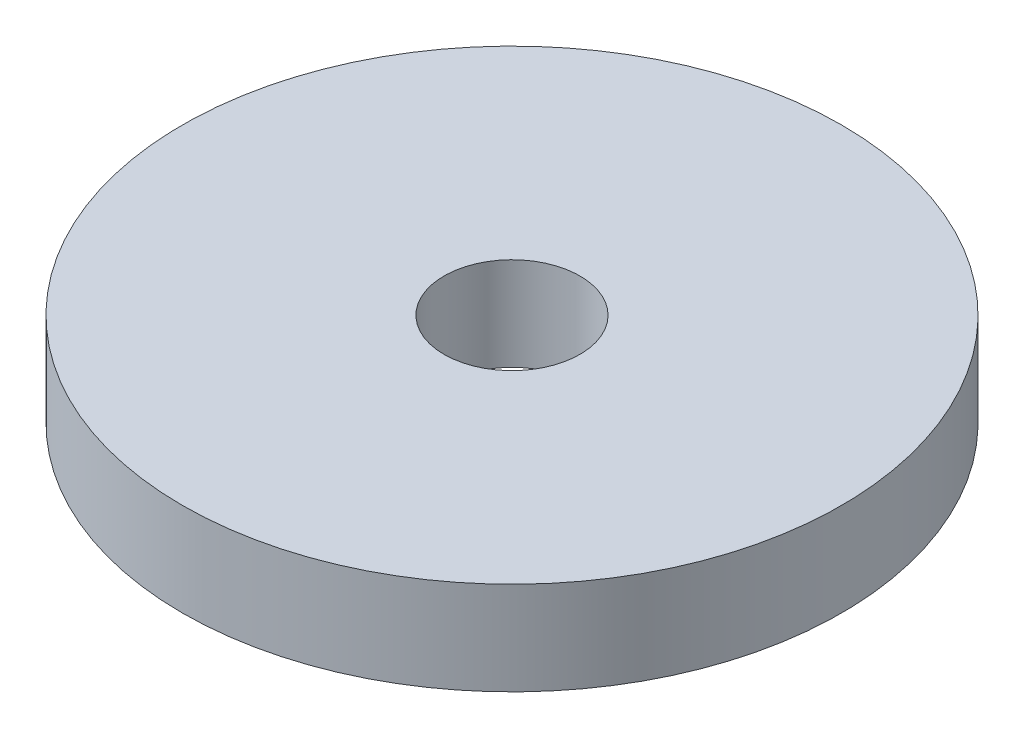
ISO-10303-21;
HEADER;
FILE_DESCRIPTION(('STEP AP214'),'2;1');
FILE_NAME('part.step','',(''),(''),'','','');
FILE_SCHEMA(('AUTOMOTIVE_DESIGN { 1 0 10303 214 1 1 1 1 }'));
ENDSEC;
DATA;
#1=APPLICATION_CONTEXT('core data for automotive mechanical design processes');
#2=APPLICATION_PROTOCOL_DEFINITION('international standard','automotive_design',2000,#1);
#3=PRODUCT_CONTEXT('',#1,'mechanical');
#4=PRODUCT('Part','Part','',(#3));
#5=PRODUCT_RELATED_PRODUCT_CATEGORY('part','',(#4));
#6=PRODUCT_DEFINITION_FORMATION('','',#4);
#7=PRODUCT_DEFINITION_CONTEXT('part definition',#1,'design');
#8=PRODUCT_DEFINITION('design','',#6,#7);
#9=PRODUCT_DEFINITION_SHAPE('','',#8);
#10=(LENGTH_UNIT() NAMED_UNIT(*) SI_UNIT(.MILLI.,.METRE.));
#11=(NAMED_UNIT(*) PLANE_ANGLE_UNIT() SI_UNIT($,.RADIAN.));
#12=(NAMED_UNIT(*) SI_UNIT($,.STERADIAN.) SOLID_ANGLE_UNIT());
#13=UNCERTAINTY_MEASURE_WITH_UNIT(LENGTH_MEASURE(1.E-05),#10,'distance_accuracy_value','');
#14=(GEOMETRIC_REPRESENTATION_CONTEXT(3) GLOBAL_UNCERTAINTY_ASSIGNED_CONTEXT((#13)) GLOBAL_UNIT_ASSIGNED_CONTEXT((#10,
#11,#12)) REPRESENTATION_CONTEXT('',''));
#15=CARTESIAN_POINT('',(0.,0.,0.));
#16=DIRECTION('',(0.,0.,1.));
#17=DIRECTION('',(1.,0.,0.));
#18=AXIS2_PLACEMENT_3D('',#15,#16,#17);
#19=CARTESIAN_POINT('',(0.,6.86,0.));
#20=DIRECTION('',(0.,-1.,0.));
#21=DIRECTION('',(0.,0.,-1.));
#22=AXIS2_PLACEMENT_3D('',#19,#20,#21);
#23=CYLINDRICAL_SURFACE('',#22,24.25);
#24=CARTESIAN_POINT('',(0.,6.86,0.));
#25=DIRECTION('',(0.,1.,0.));
#26=DIRECTION('',(0.,0.,1.));
#27=AXIS2_PLACEMENT_3D('',#24,#25,#26);
#28=CIRCLE('',#27,24.25);
#29=CARTESIAN_POINT('',(0.,6.86,24.25));
#30=VERTEX_POINT('',#29);
#31=EDGE_CURVE('E10',#30,#30,#28,.T.);
#32=ORIENTED_EDGE('',*,*,#31,.F.);
#33=EDGE_LOOP('',(#32));
#34=FACE_BOUND('',#33,.T.);
#35=CARTESIAN_POINT('',(0.,0.,0.));
#36=DIRECTION('',(0.,1.,0.));
#37=DIRECTION('',(0.,0.,1.));
#38=AXIS2_PLACEMENT_3D('',#35,#36,#37);
#39=CIRCLE('',#38,24.25);
#40=CARTESIAN_POINT('',(0.,0.,24.25));
#41=VERTEX_POINT('',#40);
#42=EDGE_CURVE('E34',#41,#41,#39,.T.);
#43=ORIENTED_EDGE('',*,*,#42,.T.);
#44=EDGE_LOOP('',(#43));
#45=FACE_BOUND('',#44,.T.);
#46=ADVANCED_FACE('F31',(#34,#45),#23,.T.);
#47=CARTESIAN_POINT('',(0.,6.86,0.));
#48=DIRECTION('',(0.,1.,0.));
#49=DIRECTION('',(0.,0.,1.));
#50=AXIS2_PLACEMENT_3D('',#47,#48,#49);
#51=PLANE('',#50);
#52=CARTESIAN_POINT('',(0.,6.86,0.));
#53=DIRECTION('',(0.,1.,0.));
#54=DIRECTION('',(0.,0.,1.));
#55=AXIS2_PLACEMENT_3D('',#52,#53,#54);
#56=CIRCLE('',#55,5.);
#57=CARTESIAN_POINT('',(0.,6.86,5.));
#58=VERTEX_POINT('',#57);
#59=EDGE_CURVE('E41',#58,#58,#56,.T.);
#60=ORIENTED_EDGE('',*,*,#59,.F.);
#61=EDGE_LOOP('',(#60));
#62=FACE_BOUND('',#61,.T.);
#63=ORIENTED_EDGE('',*,*,#31,.T.);
#64=EDGE_LOOP('',(#63));
#65=FACE_BOUND('',#64,.T.);
#66=ADVANCED_FACE('F52',(#62,#65),#51,.T.);
#67=CARTESIAN_POINT('',(0.,0.,0.));
#68=DIRECTION('',(0.,1.,0.));
#69=DIRECTION('',(0.,0.,1.));
#70=AXIS2_PLACEMENT_3D('',#67,#68,#69);
#71=PLANE('',#70);
#72=CARTESIAN_POINT('',(0.,0.,0.));
#73=DIRECTION('',(0.,1.,0.));
#74=DIRECTION('',(0.,0.,1.));
#75=AXIS2_PLACEMENT_3D('',#72,#73,#74);
#76=CIRCLE('',#75,5.);
#77=CARTESIAN_POINT('',(0.,0.,5.));
#78=VERTEX_POINT('',#77);
#79=EDGE_CURVE('E43',#78,#78,#76,.T.);
#80=ORIENTED_EDGE('',*,*,#79,.T.);
#81=EDGE_LOOP('',(#80));
#82=FACE_BOUND('',#81,.T.);
#83=ORIENTED_EDGE('',*,*,#42,.F.);
#84=EDGE_LOOP('',(#83));
#85=FACE_BOUND('',#84,.T.);
#86=ADVANCED_FACE('F54',(#82,#85),#71,.F.);
#87=CARTESIAN_POINT('',(0.,6.86,0.));
#88=DIRECTION('',(0.,-1.,0.));
#89=DIRECTION('',(0.,0.,-1.));
#90=AXIS2_PLACEMENT_3D('',#87,#88,#89);
#91=CYLINDRICAL_SURFACE('',#90,5.);
#92=ORIENTED_EDGE('',*,*,#59,.T.);
#93=EDGE_LOOP('',(#92));
#94=FACE_BOUND('',#93,.T.);
#95=ORIENTED_EDGE('',*,*,#79,.F.);
#96=EDGE_LOOP('',(#95));
#97=FACE_BOUND('',#96,.T.);
#98=ADVANCED_FACE('F49',(#94,#97),#91,.F.);
#99=CLOSED_SHELL('',(#46,#66,#86,#98));
#100=MANIFOLD_SOLID_BREP('B2',#99);
#101=ADVANCED_BREP_SHAPE_REPRESENTATION('',(#18,#100),#14);
#102=SHAPE_DEFINITION_REPRESENTATION(#9,#101);
ENDSEC;
END-ISO-10303-21;
